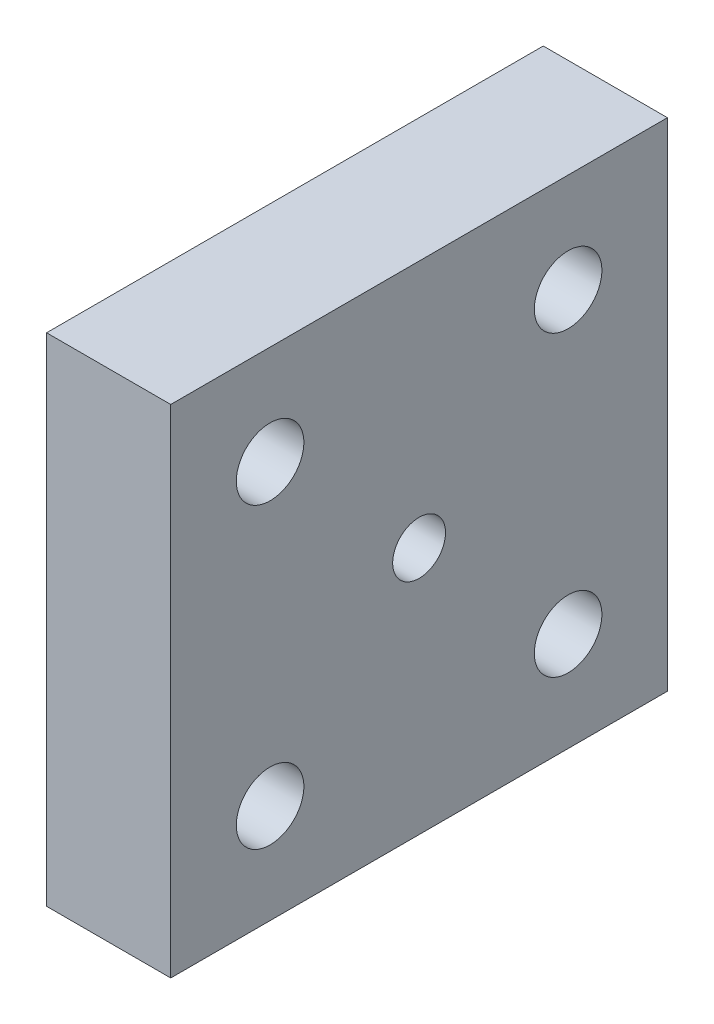
ISO-10303-21;
HEADER;
FILE_DESCRIPTION(('STEP AP214'),'2;1');
FILE_NAME('part.step','',(''),(''),'','','');
FILE_SCHEMA(('AUTOMOTIVE_DESIGN { 1 0 10303 214 1 1 1 1 }'));
ENDSEC;
DATA;
#1=APPLICATION_CONTEXT('core data for automotive mechanical design processes');
#2=APPLICATION_PROTOCOL_DEFINITION('international standard','automotive_design',2000,#1);
#3=PRODUCT_CONTEXT('',#1,'mechanical');
#4=PRODUCT('Part','Part','',(#3));
#5=PRODUCT_RELATED_PRODUCT_CATEGORY('part','',(#4));
#6=PRODUCT_DEFINITION_FORMATION('','',#4);
#7=PRODUCT_DEFINITION_CONTEXT('part definition',#1,'design');
#8=PRODUCT_DEFINITION('design','',#6,#7);
#9=PRODUCT_DEFINITION_SHAPE('','',#8);
#10=(LENGTH_UNIT() NAMED_UNIT(*) SI_UNIT(.MILLI.,.METRE.));
#11=(NAMED_UNIT(*) PLANE_ANGLE_UNIT() SI_UNIT($,.RADIAN.));
#12=(NAMED_UNIT(*) SI_UNIT($,.STERADIAN.) SOLID_ANGLE_UNIT());
#13=UNCERTAINTY_MEASURE_WITH_UNIT(LENGTH_MEASURE(1.E-05),#10,'distance_accuracy_value','');
#14=(GEOMETRIC_REPRESENTATION_CONTEXT(3) GLOBAL_UNCERTAINTY_ASSIGNED_CONTEXT((#13)) GLOBAL_UNIT_ASSIGNED_CONTEXT((#10,
#11,#12)) REPRESENTATION_CONTEXT('',''));
#15=CARTESIAN_POINT('',(0.,0.,0.));
#16=DIRECTION('',(0.,0.,1.));
#17=DIRECTION('',(1.,0.,0.));
#18=AXIS2_PLACEMENT_3D('',#15,#16,#17);
#19=CARTESIAN_POINT('',(6.35,0.,0.));
#20=DIRECTION('',(0.,0.,-1.));
#21=DIRECTION('',(-1.,0.,0.));
#22=AXIS2_PLACEMENT_3D('',#19,#20,#21);
#23=PLANE('',#22);
#24=DIRECTION('',(0.,-1.,0.));
#25=VECTOR('',#24,1.);
#26=CARTESIAN_POINT('',(0.,0.,0.));
#27=LINE('',#26,#25);
#28=CARTESIAN_POINT('',(0.,0.,0.));
#29=VERTEX_POINT('',#28);
#30=CARTESIAN_POINT('',(0.,-25.4,0.));
#31=VERTEX_POINT('',#30);
#32=EDGE_CURVE('E98',#29,#31,#27,.T.);
#33=ORIENTED_EDGE('',*,*,#32,.T.);
#34=DIRECTION('',(-1.,0.,0.));
#35=VECTOR('',#34,1.);
#36=CARTESIAN_POINT('',(6.35,-25.4,0.));
#37=LINE('',#36,#35);
#38=CARTESIAN_POINT('',(6.35,-25.4,0.));
#39=VERTEX_POINT('',#38);
#40=EDGE_CURVE('E11',#39,#31,#37,.T.);
#41=ORIENTED_EDGE('',*,*,#40,.F.);
#42=DIRECTION('',(0.,-1.,0.));
#43=VECTOR('',#42,1.);
#44=CARTESIAN_POINT('',(6.35,0.,0.));
#45=LINE('',#44,#43);
#46=CARTESIAN_POINT('',(6.35,0.,0.));
#47=VERTEX_POINT('',#46);
#48=EDGE_CURVE('E86',#47,#39,#45,.T.);
#49=ORIENTED_EDGE('',*,*,#48,.F.);
#50=DIRECTION('',(-1.,0.,0.));
#51=VECTOR('',#50,1.);
#52=CARTESIAN_POINT('',(6.35,0.,0.));
#53=LINE('',#52,#51);
#54=EDGE_CURVE('E94',#47,#29,#53,.T.);
#55=ORIENTED_EDGE('',*,*,#54,.T.);
#56=EDGE_LOOP('',(#33,#41,#49,#55));
#57=FACE_BOUND('',#56,.T.);
#58=ADVANCED_FACE('F35',(#57),#23,.F.);
#59=CARTESIAN_POINT('',(6.35,-25.4,0.));
#60=DIRECTION('',(0.,1.,0.));
#61=DIRECTION('',(0.,0.,1.));
#62=AXIS2_PLACEMENT_3D('',#59,#60,#61);
#63=PLANE('',#62);
#64=DIRECTION('',(0.,0.,-1.));
#65=VECTOR('',#64,1.);
#66=CARTESIAN_POINT('',(0.,-25.4,0.));
#67=LINE('',#66,#65);
#68=CARTESIAN_POINT('',(0.,-25.4,-25.4));
#69=VERTEX_POINT('',#68);
#70=EDGE_CURVE('E90',#31,#69,#67,.T.);
#71=ORIENTED_EDGE('',*,*,#70,.T.);
#72=DIRECTION('',(-1.,0.,0.));
#73=VECTOR('',#72,1.);
#74=CARTESIAN_POINT('',(6.35,-25.4,-25.4));
#75=LINE('',#74,#73);
#76=CARTESIAN_POINT('',(6.35,-25.4,-25.4));
#77=VERTEX_POINT('',#76);
#78=EDGE_CURVE('E43',#77,#69,#75,.T.);
#79=ORIENTED_EDGE('',*,*,#78,.F.);
#80=DIRECTION('',(0.,0.,-1.));
#81=VECTOR('',#80,1.);
#82=CARTESIAN_POINT('',(6.35,-25.4,0.));
#83=LINE('',#82,#81);
#84=EDGE_CURVE('E81',#39,#77,#83,.T.);
#85=ORIENTED_EDGE('',*,*,#84,.F.);
#86=ORIENTED_EDGE('',*,*,#40,.T.);
#87=EDGE_LOOP('',(#71,#79,#85,#86));
#88=FACE_BOUND('',#87,.T.);
#89=ADVANCED_FACE('F89',(#88),#63,.F.);
#90=CARTESIAN_POINT('',(6.35,0.,-25.4));
#91=DIRECTION('',(0.,0.,1.));
#92=DIRECTION('',(1.,0.,0.));
#93=AXIS2_PLACEMENT_3D('',#90,#91,#92);
#94=PLANE('',#93);
#95=DIRECTION('',(0.,1.,0.));
#96=VECTOR('',#95,1.);
#97=CARTESIAN_POINT('',(0.,0.,-25.4));
#98=LINE('',#97,#96);
#99=CARTESIAN_POINT('',(0.,0.,-25.4));
#100=VERTEX_POINT('',#99);
#101=EDGE_CURVE('E68',#69,#100,#98,.T.);
#102=ORIENTED_EDGE('',*,*,#101,.T.);
#103=DIRECTION('',(-1.,0.,0.));
#104=VECTOR('',#103,1.);
#105=CARTESIAN_POINT('',(6.35,0.,-25.4));
#106=LINE('',#105,#104);
#107=CARTESIAN_POINT('',(6.35,0.,-25.4));
#108=VERTEX_POINT('',#107);
#109=EDGE_CURVE('E91',#108,#100,#106,.T.);
#110=ORIENTED_EDGE('',*,*,#109,.F.);
#111=DIRECTION('',(0.,1.,0.));
#112=VECTOR('',#111,1.);
#113=CARTESIAN_POINT('',(6.35,0.,-25.4));
#114=LINE('',#113,#112);
#115=EDGE_CURVE('E84',#77,#108,#114,.T.);
#116=ORIENTED_EDGE('',*,*,#115,.F.);
#117=ORIENTED_EDGE('',*,*,#78,.T.);
#118=EDGE_LOOP('',(#102,#110,#116,#117));
#119=FACE_BOUND('',#118,.T.);
#120=ADVANCED_FACE('F92',(#119),#94,.F.);
#121=CARTESIAN_POINT('',(6.35,0.,0.));
#122=DIRECTION('',(0.,-1.,0.));
#123=DIRECTION('',(0.,0.,-1.));
#124=AXIS2_PLACEMENT_3D('',#121,#122,#123);
#125=PLANE('',#124);
#126=DIRECTION('',(0.,0.,1.));
#127=VECTOR('',#126,1.);
#128=CARTESIAN_POINT('',(0.,0.,0.));
#129=LINE('',#128,#127);
#130=EDGE_CURVE('E74',#100,#29,#129,.T.);
#131=ORIENTED_EDGE('',*,*,#130,.T.);
#132=ORIENTED_EDGE('',*,*,#54,.F.);
#133=DIRECTION('',(0.,0.,1.));
#134=VECTOR('',#133,1.);
#135=CARTESIAN_POINT('',(6.35,0.,0.));
#136=LINE('',#135,#134);
#137=EDGE_CURVE('E51',#108,#47,#136,.T.);
#138=ORIENTED_EDGE('',*,*,#137,.F.);
#139=ORIENTED_EDGE('',*,*,#109,.T.);
#140=EDGE_LOOP('',(#131,#132,#138,#139));
#141=FACE_BOUND('',#140,.T.);
#142=ADVANCED_FACE('F106',(#141),#125,.F.);
#143=CARTESIAN_POINT('',(6.35,0.,0.));
#144=DIRECTION('',(1.,0.,0.));
#145=DIRECTION('',(0.,0.,-1.));
#146=AXIS2_PLACEMENT_3D('',#143,#144,#145);
#147=PLANE('',#146);
#148=CARTESIAN_POINT('',(6.35,-12.7,-12.7));
#149=DIRECTION('',(-1.,0.,0.));
#150=DIRECTION('',(0.,0.,1.));
#151=AXIS2_PLACEMENT_3D('',#148,#149,#150);
#152=CIRCLE('',#151,1.35255);
#153=CARTESIAN_POINT('',(6.35,-12.7,-11.34745));
#154=VERTEX_POINT('',#153);
#155=EDGE_CURVE('E135',#154,#154,#152,.T.);
#156=ORIENTED_EDGE('',*,*,#155,.T.);
#157=EDGE_LOOP('',(#156));
#158=FACE_BOUND('',#157,.T.);
#159=CARTESIAN_POINT('',(6.35,-20.32,-20.32));
#160=DIRECTION('',(-1.,0.,0.));
#161=DIRECTION('',(0.,0.,1.));
#162=AXIS2_PLACEMENT_3D('',#159,#160,#161);
#163=CIRCLE('',#162,1.7272);
#164=CARTESIAN_POINT('',(6.35,-20.32,-18.5928));
#165=VERTEX_POINT('',#164);
#166=EDGE_CURVE('E129',#165,#165,#163,.T.);
#167=ORIENTED_EDGE('',*,*,#166,.T.);
#168=EDGE_LOOP('',(#167));
#169=FACE_BOUND('',#168,.T.);
#170=CARTESIAN_POINT('',(6.35,-5.08,-20.32));
#171=DIRECTION('',(-1.,0.,0.));
#172=DIRECTION('',(0.,0.,1.));
#173=AXIS2_PLACEMENT_3D('',#170,#171,#172);
#174=CIRCLE('',#173,1.7272);
#175=CARTESIAN_POINT('',(6.35,-5.08,-18.5928));
#176=VERTEX_POINT('',#175);
#177=EDGE_CURVE('E123',#176,#176,#174,.T.);
#178=ORIENTED_EDGE('',*,*,#177,.T.);
#179=EDGE_LOOP('',(#178));
#180=FACE_BOUND('',#179,.T.);
#181=CARTESIAN_POINT('',(6.35,-5.08,-5.08));
#182=DIRECTION('',(-1.,0.,0.));
#183=DIRECTION('',(0.,0.,1.));
#184=AXIS2_PLACEMENT_3D('',#181,#182,#183);
#185=CIRCLE('',#184,1.7272);
#186=CARTESIAN_POINT('',(6.35,-5.08,-3.35280000000001));
#187=VERTEX_POINT('',#186);
#188=EDGE_CURVE('E117',#187,#187,#185,.T.);
#189=ORIENTED_EDGE('',*,*,#188,.T.);
#190=EDGE_LOOP('',(#189));
#191=FACE_BOUND('',#190,.T.);
#192=CARTESIAN_POINT('',(6.35,-20.32,-5.08));
#193=DIRECTION('',(-1.,0.,0.));
#194=DIRECTION('',(0.,0.,1.));
#195=AXIS2_PLACEMENT_3D('',#192,#193,#194);
#196=CIRCLE('',#195,1.7272);
#197=CARTESIAN_POINT('',(6.35,-20.32,-3.3528));
#198=VERTEX_POINT('',#197);
#199=EDGE_CURVE('E101',#198,#198,#196,.T.);
#200=ORIENTED_EDGE('',*,*,#199,.T.);
#201=EDGE_LOOP('',(#200));
#202=FACE_BOUND('',#201,.T.);
#203=ORIENTED_EDGE('',*,*,#48,.T.);
#204=ORIENTED_EDGE('',*,*,#84,.T.);
#205=ORIENTED_EDGE('',*,*,#115,.T.);
#206=ORIENTED_EDGE('',*,*,#137,.T.);
#207=EDGE_LOOP('',(#203,#204,#205,#206));
#208=FACE_BOUND('',#207,.T.);
#209=ADVANCED_FACE('F82',(#158,#169,#180,#191,#202,#208),#147,.T.);
#210=CARTESIAN_POINT('',(0.,0.,0.));
#211=DIRECTION('',(1.,0.,0.));
#212=DIRECTION('',(0.,0.,-1.));
#213=AXIS2_PLACEMENT_3D('',#210,#211,#212);
#214=PLANE('',#213);
#215=CARTESIAN_POINT('',(0.,-12.7,-12.7));
#216=DIRECTION('',(-1.,0.,0.));
#217=DIRECTION('',(0.,0.,1.));
#218=AXIS2_PLACEMENT_3D('',#215,#216,#217);
#219=CIRCLE('',#218,1.35255);
#220=CARTESIAN_POINT('',(0.,-12.7,-11.34745));
#221=VERTEX_POINT('',#220);
#222=EDGE_CURVE('E138',#221,#221,#219,.T.);
#223=ORIENTED_EDGE('',*,*,#222,.F.);
#224=EDGE_LOOP('',(#223));
#225=FACE_BOUND('',#224,.T.);
#226=CARTESIAN_POINT('',(0.,-20.32,-20.32));
#227=DIRECTION('',(-1.,0.,0.));
#228=DIRECTION('',(0.,0.,1.));
#229=AXIS2_PLACEMENT_3D('',#226,#227,#228);
#230=CIRCLE('',#229,1.72719999999999);
#231=CARTESIAN_POINT('',(0.,-20.32,-18.5928));
#232=VERTEX_POINT('',#231);
#233=EDGE_CURVE('E132',#232,#232,#230,.T.);
#234=ORIENTED_EDGE('',*,*,#233,.F.);
#235=EDGE_LOOP('',(#234));
#236=FACE_BOUND('',#235,.T.);
#237=CARTESIAN_POINT('',(0.,-5.08,-20.32));
#238=DIRECTION('',(-1.,0.,0.));
#239=DIRECTION('',(0.,0.,1.));
#240=AXIS2_PLACEMENT_3D('',#237,#238,#239);
#241=CIRCLE('',#240,1.72719999999999);
#242=CARTESIAN_POINT('',(0.,-5.08,-18.5928));
#243=VERTEX_POINT('',#242);
#244=EDGE_CURVE('E126',#243,#243,#241,.T.);
#245=ORIENTED_EDGE('',*,*,#244,.F.);
#246=EDGE_LOOP('',(#245));
#247=FACE_BOUND('',#246,.T.);
#248=CARTESIAN_POINT('',(0.,-5.08,-5.08));
#249=DIRECTION('',(-1.,0.,0.));
#250=DIRECTION('',(0.,0.,1.));
#251=AXIS2_PLACEMENT_3D('',#248,#249,#250);
#252=CIRCLE('',#251,1.72719999999999);
#253=CARTESIAN_POINT('',(0.,-5.08,-3.35280000000002));
#254=VERTEX_POINT('',#253);
#255=EDGE_CURVE('E120',#254,#254,#252,.T.);
#256=ORIENTED_EDGE('',*,*,#255,.F.);
#257=EDGE_LOOP('',(#256));
#258=FACE_BOUND('',#257,.T.);
#259=CARTESIAN_POINT('',(0.,-20.32,-5.08));
#260=DIRECTION('',(-1.,0.,0.));
#261=DIRECTION('',(0.,0.,1.));
#262=AXIS2_PLACEMENT_3D('',#259,#260,#261);
#263=CIRCLE('',#262,1.72719999999999);
#264=CARTESIAN_POINT('',(0.,-20.32,-3.35280000000001));
#265=VERTEX_POINT('',#264);
#266=EDGE_CURVE('E114',#265,#265,#263,.T.);
#267=ORIENTED_EDGE('',*,*,#266,.F.);
#268=EDGE_LOOP('',(#267));
#269=FACE_BOUND('',#268,.T.);
#270=ORIENTED_EDGE('',*,*,#32,.F.);
#271=ORIENTED_EDGE('',*,*,#130,.F.);
#272=ORIENTED_EDGE('',*,*,#101,.F.);
#273=ORIENTED_EDGE('',*,*,#70,.F.);
#274=EDGE_LOOP('',(#270,#271,#272,#273));
#275=FACE_BOUND('',#274,.T.);
#276=ADVANCED_FACE('F109',(#225,#236,#247,#258,#269,#275),#214,.F.);
#277=CARTESIAN_POINT('',(0.,-20.32,-5.08));
#278=DIRECTION('',(-1.,0.,0.));
#279=DIRECTION('',(0.,0.,1.));
#280=AXIS2_PLACEMENT_3D('',#277,#278,#279);
#281=CYLINDRICAL_SURFACE('',#280,1.72719999999999);
#282=ORIENTED_EDGE('',*,*,#199,.F.);
#283=EDGE_LOOP('',(#282));
#284=FACE_BOUND('',#283,.T.);
#285=ORIENTED_EDGE('',*,*,#266,.T.);
#286=EDGE_LOOP('',(#285));
#287=FACE_BOUND('',#286,.T.);
#288=ADVANCED_FACE('F146',(#284,#287),#281,.F.);
#289=CARTESIAN_POINT('',(0.,-5.08,-5.08));
#290=DIRECTION('',(-1.,0.,0.));
#291=DIRECTION('',(0.,0.,1.));
#292=AXIS2_PLACEMENT_3D('',#289,#290,#291);
#293=CYLINDRICAL_SURFACE('',#292,1.72719999999999);
#294=ORIENTED_EDGE('',*,*,#188,.F.);
#295=EDGE_LOOP('',(#294));
#296=FACE_BOUND('',#295,.T.);
#297=ORIENTED_EDGE('',*,*,#255,.T.);
#298=EDGE_LOOP('',(#297));
#299=FACE_BOUND('',#298,.T.);
#300=ADVANCED_FACE('F157',(#296,#299),#293,.F.);
#301=CARTESIAN_POINT('',(0.,-5.08,-20.32));
#302=DIRECTION('',(-1.,0.,0.));
#303=DIRECTION('',(0.,0.,1.));
#304=AXIS2_PLACEMENT_3D('',#301,#302,#303);
#305=CYLINDRICAL_SURFACE('',#304,1.72719999999999);
#306=ORIENTED_EDGE('',*,*,#177,.F.);
#307=EDGE_LOOP('',(#306));
#308=FACE_BOUND('',#307,.T.);
#309=ORIENTED_EDGE('',*,*,#244,.T.);
#310=EDGE_LOOP('',(#309));
#311=FACE_BOUND('',#310,.T.);
#312=ADVANCED_FACE('F163',(#308,#311),#305,.F.);
#313=CARTESIAN_POINT('',(0.,-20.32,-20.32));
#314=DIRECTION('',(-1.,0.,0.));
#315=DIRECTION('',(0.,0.,1.));
#316=AXIS2_PLACEMENT_3D('',#313,#314,#315);
#317=CYLINDRICAL_SURFACE('',#316,1.72719999999999);
#318=ORIENTED_EDGE('',*,*,#166,.F.);
#319=EDGE_LOOP('',(#318));
#320=FACE_BOUND('',#319,.T.);
#321=ORIENTED_EDGE('',*,*,#233,.T.);
#322=EDGE_LOOP('',(#321));
#323=FACE_BOUND('',#322,.T.);
#324=ADVANCED_FACE('F194',(#320,#323),#317,.F.);
#325=CARTESIAN_POINT('',(0.,-12.7,-12.7));
#326=DIRECTION('',(-1.,0.,0.));
#327=DIRECTION('',(0.,0.,1.));
#328=AXIS2_PLACEMENT_3D('',#325,#326,#327);
#329=CYLINDRICAL_SURFACE('',#328,1.35255);
#330=ORIENTED_EDGE('',*,*,#155,.F.);
#331=EDGE_LOOP('',(#330));
#332=FACE_BOUND('',#331,.T.);
#333=ORIENTED_EDGE('',*,*,#222,.T.);
#334=EDGE_LOOP('',(#333));
#335=FACE_BOUND('',#334,.T.);
#336=ADVANCED_FACE('F142',(#332,#335),#329,.F.);
#337=CLOSED_SHELL('',(#58,#89,#120,#142,#209,#276,#288,#300,#312,#324,#336));
#338=MANIFOLD_SOLID_BREP('B2',#337);
#339=ADVANCED_BREP_SHAPE_REPRESENTATION('',(#18,#338),#14);
#340=SHAPE_DEFINITION_REPRESENTATION(#9,#339);
ENDSEC;
END-ISO-10303-21;
